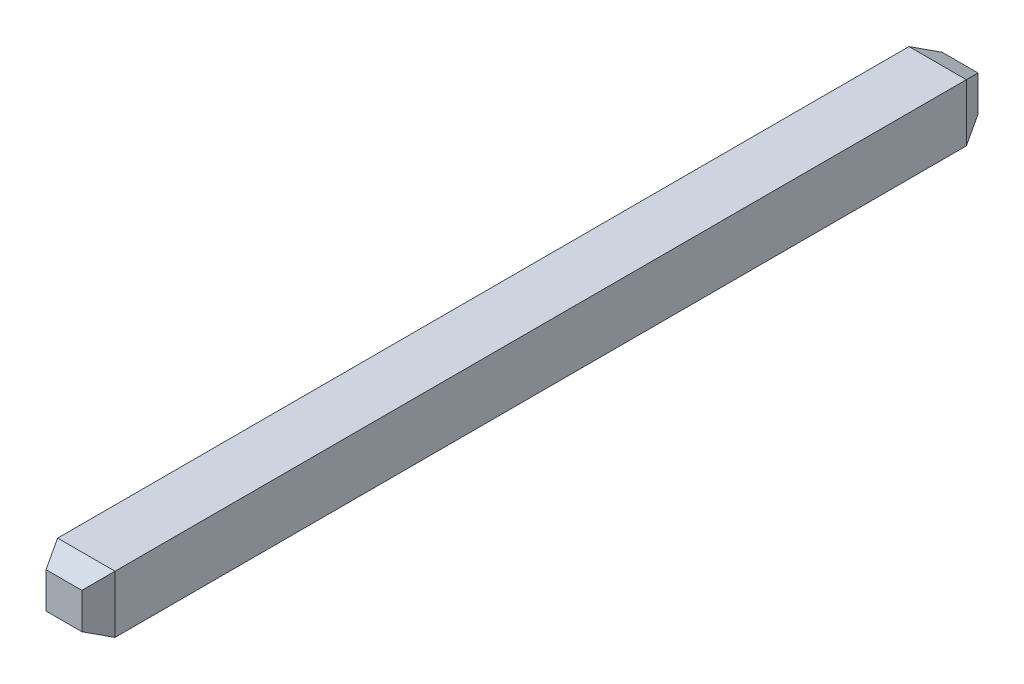
ISO-10303-21;
HEADER;
FILE_DESCRIPTION(('STEP AP214'),'2;1');
FILE_NAME('part.step','',(''),(''),'','','');
FILE_SCHEMA(('AUTOMOTIVE_DESIGN { 1 0 10303 214 1 1 1 1 }'));
ENDSEC;
DATA;
#1=APPLICATION_CONTEXT('core data for automotive mechanical design processes');
#2=APPLICATION_PROTOCOL_DEFINITION('international standard','automotive_design',2000,#1);
#3=PRODUCT_CONTEXT('',#1,'mechanical');
#4=PRODUCT('Part','Part','',(#3));
#5=PRODUCT_RELATED_PRODUCT_CATEGORY('part','',(#4));
#6=PRODUCT_DEFINITION_FORMATION('','',#4);
#7=PRODUCT_DEFINITION_CONTEXT('part definition',#1,'design');
#8=PRODUCT_DEFINITION('design','',#6,#7);
#9=PRODUCT_DEFINITION_SHAPE('','',#8);
#10=(LENGTH_UNIT() NAMED_UNIT(*) SI_UNIT(.MILLI.,.METRE.));
#11=(NAMED_UNIT(*) PLANE_ANGLE_UNIT() SI_UNIT($,.RADIAN.));
#12=(NAMED_UNIT(*) SI_UNIT($,.STERADIAN.) SOLID_ANGLE_UNIT());
#13=UNCERTAINTY_MEASURE_WITH_UNIT(LENGTH_MEASURE(1.E-05),#10,'distance_accuracy_value','');
#14=(GEOMETRIC_REPRESENTATION_CONTEXT(3) GLOBAL_UNCERTAINTY_ASSIGNED_CONTEXT((#13)) GLOBAL_UNIT_ASSIGNED_CONTEXT((#10,
#11,#12)) REPRESENTATION_CONTEXT('',''));
#15=CARTESIAN_POINT('',(0.,0.,0.));
#16=DIRECTION('',(0.,0.,1.));
#17=DIRECTION('',(1.,0.,0.));
#18=AXIS2_PLACEMENT_3D('',#15,#16,#17);
#19=CARTESIAN_POINT('',(0.16,0.32,2.5));
#20=DIRECTION('',(0.,1.,0.));
#21=DIRECTION('',(1.,0.,0.));
#22=AXIS2_PLACEMENT_3D('',#19,#20,#21);
#23=PLANE('',#22);
#24=DIRECTION('',(1.,0.,0.));
#25=VECTOR('',#24,1.);
#26=CARTESIAN_POINT('',(-0.08,0.32,4.75));
#27=LINE('',#26,#25);
#28=CARTESIAN_POINT('',(-0.32,0.32,4.75));
#29=VERTEX_POINT('',#28);
#30=CARTESIAN_POINT('',(0.32,0.32,4.75));
#31=VERTEX_POINT('',#30);
#32=EDGE_CURVE('E102',#29,#31,#27,.T.);
#33=ORIENTED_EDGE('',*,*,#32,.T.);
#34=DIRECTION('',(0.,0.,-1.));
#35=VECTOR('',#34,1.);
#36=CARTESIAN_POINT('',(0.32,0.32,0.));
#37=LINE('',#36,#35);
#38=CARTESIAN_POINT('',(0.32,0.32,-4.75));
#39=VERTEX_POINT('',#38);
#40=EDGE_CURVE('E27',#31,#39,#37,.T.);
#41=ORIENTED_EDGE('',*,*,#40,.T.);
#42=DIRECTION('',(1.,0.,0.));
#43=VECTOR('',#42,1.);
#44=CARTESIAN_POINT('',(-0.08,0.32,-4.75));
#45=LINE('',#44,#43);
#46=CARTESIAN_POINT('',(-0.32,0.32,-4.75));
#47=VERTEX_POINT('',#46);
#48=EDGE_CURVE('E133',#47,#39,#45,.T.);
#49=ORIENTED_EDGE('',*,*,#48,.F.);
#50=DIRECTION('',(0.,0.,1.));
#51=VECTOR('',#50,1.);
#52=CARTESIAN_POINT('',(-0.32,0.32,0.));
#53=LINE('',#52,#51);
#54=EDGE_CURVE('E207',#47,#29,#53,.T.);
#55=ORIENTED_EDGE('',*,*,#54,.T.);
#56=EDGE_LOOP('',(#33,#41,#49,#55));
#57=FACE_BOUND('',#56,.T.);
#58=ADVANCED_FACE('F17',(#57),#23,.T.);
#59=CARTESIAN_POINT('',(0.2,0.,5.));
#60=DIRECTION('',(0.901523057468274,0.,0.432731067584771));
#61=DIRECTION('',(0.,-1.,0.));
#62=AXIS2_PLACEMENT_3D('',#59,#60,#61);
#63=PLANE('',#62);
#64=DIRECTION('',(0.397142035392897,0.397142035392897,-0.827379240401869));
#65=VECTOR('',#64,1.);
#66=CARTESIAN_POINT('',(0.218992332968237,0.218992332968237,4.96043263964951));
#67=LINE('',#66,#65);
#68=CARTESIAN_POINT('',(0.2,0.2,5.));
#69=VERTEX_POINT('',#68);
#70=EDGE_CURVE('E176',#69,#31,#67,.T.);
#71=ORIENTED_EDGE('',*,*,#70,.F.);
#72=DIRECTION('',(0.,1.,0.));
#73=VECTOR('',#72,1.);
#74=CARTESIAN_POINT('',(0.2,0.,5.));
#75=LINE('',#74,#73);
#76=CARTESIAN_POINT('',(0.2,-0.2,5.));
#77=VERTEX_POINT('',#76);
#78=EDGE_CURVE('E61',#77,#69,#75,.T.);
#79=ORIENTED_EDGE('',*,*,#78,.F.);
#80=DIRECTION('',(0.397142035392897,-0.397142035392897,-0.827379240401869));
#81=VECTOR('',#80,1.);
#82=CARTESIAN_POINT('',(0.218992332968237,-0.218992332968237,4.96043263964951));
#83=LINE('',#82,#81);
#84=CARTESIAN_POINT('',(0.32,-0.32,4.75));
#85=VERTEX_POINT('',#84);
#86=EDGE_CURVE('E168',#77,#85,#83,.T.);
#87=ORIENTED_EDGE('',*,*,#86,.T.);
#88=DIRECTION('',(0.,1.,0.));
#89=VECTOR('',#88,1.);
#90=CARTESIAN_POINT('',(0.32,0.,4.75));
#91=LINE('',#90,#89);
#92=EDGE_CURVE('E11',#85,#31,#91,.T.);
#93=ORIENTED_EDGE('',*,*,#92,.T.);
#94=EDGE_LOOP('',(#71,#79,#87,#93));
#95=FACE_BOUND('',#94,.T.);
#96=ADVANCED_FACE('F19',(#95),#63,.T.);
#97=CARTESIAN_POINT('',(0.32,0.,4.75));
#98=DIRECTION('',(1.,0.,0.));
#99=DIRECTION('',(0.,1.,0.));
#100=AXIS2_PLACEMENT_3D('',#97,#98,#99);
#101=PLANE('',#100);
#102=ORIENTED_EDGE('',*,*,#40,.F.);
#103=ORIENTED_EDGE('',*,*,#92,.F.);
#104=DIRECTION('',(0.,0.,1.));
#105=VECTOR('',#104,1.);
#106=CARTESIAN_POINT('',(0.32,-0.32,0.));
#107=LINE('',#106,#105);
#108=CARTESIAN_POINT('',(0.32,-0.32,-4.75));
#109=VERTEX_POINT('',#108);
#110=EDGE_CURVE('E111',#109,#85,#107,.T.);
#111=ORIENTED_EDGE('',*,*,#110,.F.);
#112=DIRECTION('',(0.,1.,0.));
#113=VECTOR('',#112,1.);
#114=CARTESIAN_POINT('',(0.32,0.,-4.75));
#115=LINE('',#114,#113);
#116=EDGE_CURVE('E132',#109,#39,#115,.T.);
#117=ORIENTED_EDGE('',*,*,#116,.T.);
#118=EDGE_LOOP('',(#102,#103,#111,#117));
#119=FACE_BOUND('',#118,.T.);
#120=ADVANCED_FACE('F226',(#119),#101,.T.);
#121=CARTESIAN_POINT('',(0.,0.,5.));
#122=DIRECTION('',(0.,0.,1.));
#123=DIRECTION('',(1.,0.,0.));
#124=AXIS2_PLACEMENT_3D('',#121,#122,#123);
#125=PLANE('',#124);
#126=DIRECTION('',(1.,0.,0.));
#127=VECTOR('',#126,1.);
#128=CARTESIAN_POINT('',(0.,0.2,5.));
#129=LINE('',#128,#127);
#130=CARTESIAN_POINT('',(-0.2,0.2,5.));
#131=VERTEX_POINT('',#130);
#132=EDGE_CURVE('E215',#131,#69,#129,.T.);
#133=ORIENTED_EDGE('',*,*,#132,.F.);
#134=DIRECTION('',(0.,1.,0.));
#135=VECTOR('',#134,1.);
#136=CARTESIAN_POINT('',(-0.2,0.,5.));
#137=LINE('',#136,#135);
#138=CARTESIAN_POINT('',(-0.2,-0.2,5.));
#139=VERTEX_POINT('',#138);
#140=EDGE_CURVE('E172',#139,#131,#137,.T.);
#141=ORIENTED_EDGE('',*,*,#140,.F.);
#142=DIRECTION('',(1.,0.,0.));
#143=VECTOR('',#142,1.);
#144=CARTESIAN_POINT('',(0.,-0.2,5.));
#145=LINE('',#144,#143);
#146=EDGE_CURVE('E164',#139,#77,#145,.T.);
#147=ORIENTED_EDGE('',*,*,#146,.T.);
#148=ORIENTED_EDGE('',*,*,#78,.T.);
#149=EDGE_LOOP('',(#133,#141,#147,#148));
#150=FACE_BOUND('',#149,.T.);
#151=ADVANCED_FACE('F251',(#150),#125,.T.);
#152=CARTESIAN_POINT('',(0.,0.32,4.75));
#153=DIRECTION('',(0.,0.901523057468274,0.432731067584771));
#154=DIRECTION('',(1.,0.,0.));
#155=AXIS2_PLACEMENT_3D('',#152,#153,#154);
#156=PLANE('',#155);
#157=ORIENTED_EDGE('',*,*,#70,.T.);
#158=ORIENTED_EDGE('',*,*,#32,.F.);
#159=DIRECTION('',(-0.397142035392897,0.397142035392897,-0.827379240401869));
#160=VECTOR('',#159,1.);
#161=CARTESIAN_POINT('',(-0.218992332968237,0.218992332968237,4.96043263964951));
#162=LINE('',#161,#160);
#163=EDGE_CURVE('E177',#131,#29,#162,.T.);
#164=ORIENTED_EDGE('',*,*,#163,.F.);
#165=ORIENTED_EDGE('',*,*,#132,.T.);
#166=EDGE_LOOP('',(#157,#158,#164,#165));
#167=FACE_BOUND('',#166,.T.);
#168=ADVANCED_FACE('F244',(#167),#156,.T.);
#169=CARTESIAN_POINT('',(-0.2,0.,5.));
#170=DIRECTION('',(0.901523057468274,0.,-0.432731067584771));
#171=DIRECTION('',(0.,-1.,0.));
#172=AXIS2_PLACEMENT_3D('',#169,#170,#171);
#173=PLANE('',#172);
#174=ORIENTED_EDGE('',*,*,#163,.T.);
#175=DIRECTION('',(0.,-1.,0.));
#176=VECTOR('',#175,1.);
#177=CARTESIAN_POINT('',(-0.32,0.,4.75));
#178=LINE('',#177,#176);
#179=CARTESIAN_POINT('',(-0.32,-0.32,4.75));
#180=VERTEX_POINT('',#179);
#181=EDGE_CURVE('E90',#29,#180,#178,.T.);
#182=ORIENTED_EDGE('',*,*,#181,.T.);
#183=DIRECTION('',(-0.397142035392897,-0.397142035392897,-0.827379240401869));
#184=VECTOR('',#183,1.);
#185=CARTESIAN_POINT('',(-0.218992332968237,-0.218992332968237,4.96043263964951));
#186=LINE('',#185,#184);
#187=EDGE_CURVE('E167',#139,#180,#186,.T.);
#188=ORIENTED_EDGE('',*,*,#187,.F.);
#189=ORIENTED_EDGE('',*,*,#140,.T.);
#190=EDGE_LOOP('',(#174,#182,#188,#189));
#191=FACE_BOUND('',#190,.T.);
#192=ADVANCED_FACE('F242',(#191),#173,.F.);
#193=CARTESIAN_POINT('',(-0.32,0.,4.75));
#194=DIRECTION('',(1.,0.,0.));
#195=DIRECTION('',(0.,0.,-1.));
#196=AXIS2_PLACEMENT_3D('',#193,#194,#195);
#197=PLANE('',#196);
#198=ORIENTED_EDGE('',*,*,#181,.F.);
#199=ORIENTED_EDGE('',*,*,#54,.F.);
#200=DIRECTION('',(0.,-1.,0.));
#201=VECTOR('',#200,1.);
#202=CARTESIAN_POINT('',(-0.32,0.,-4.75));
#203=LINE('',#202,#201);
#204=CARTESIAN_POINT('',(-0.32,-0.32,-4.75));
#205=VERTEX_POINT('',#204);
#206=EDGE_CURVE('E156',#47,#205,#203,.T.);
#207=ORIENTED_EDGE('',*,*,#206,.T.);
#208=DIRECTION('',(0.,0.,1.));
#209=VECTOR('',#208,1.);
#210=CARTESIAN_POINT('',(-0.32,-0.32,0.));
#211=LINE('',#210,#209);
#212=EDGE_CURVE('E200',#205,#180,#211,.T.);
#213=ORIENTED_EDGE('',*,*,#212,.T.);
#214=EDGE_LOOP('',(#198,#199,#207,#213));
#215=FACE_BOUND('',#214,.T.);
#216=ADVANCED_FACE('F234',(#215),#197,.F.);
#217=CARTESIAN_POINT('',(0.16,-0.32,2.5));
#218=DIRECTION('',(0.,1.,0.));
#219=DIRECTION('',(1.,0.,0.));
#220=AXIS2_PLACEMENT_3D('',#217,#218,#219);
#221=PLANE('',#220);
#222=DIRECTION('',(1.,0.,0.));
#223=VECTOR('',#222,1.);
#224=CARTESIAN_POINT('',(-0.08,-0.32,4.75));
#225=LINE('',#224,#223);
#226=EDGE_CURVE('E196',#180,#85,#225,.T.);
#227=ORIENTED_EDGE('',*,*,#226,.F.);
#228=ORIENTED_EDGE('',*,*,#212,.F.);
#229=DIRECTION('',(1.,0.,0.));
#230=VECTOR('',#229,1.);
#231=CARTESIAN_POINT('',(-0.08,-0.32,-4.75));
#232=LINE('',#231,#230);
#233=EDGE_CURVE('E148',#205,#109,#232,.T.);
#234=ORIENTED_EDGE('',*,*,#233,.T.);
#235=ORIENTED_EDGE('',*,*,#110,.T.);
#236=EDGE_LOOP('',(#227,#228,#234,#235));
#237=FACE_BOUND('',#236,.T.);
#238=ADVANCED_FACE('F237',(#237),#221,.F.);
#239=CARTESIAN_POINT('',(0.,-0.32,4.75));
#240=DIRECTION('',(0.,0.901523057468274,-0.432731067584771));
#241=DIRECTION('',(-1.,0.,0.));
#242=AXIS2_PLACEMENT_3D('',#239,#240,#241);
#243=PLANE('',#242);
#244=ORIENTED_EDGE('',*,*,#86,.F.);
#245=ORIENTED_EDGE('',*,*,#146,.F.);
#246=ORIENTED_EDGE('',*,*,#187,.T.);
#247=ORIENTED_EDGE('',*,*,#226,.T.);
#248=EDGE_LOOP('',(#244,#245,#246,#247));
#249=FACE_BOUND('',#248,.T.);
#250=ADVANCED_FACE('F241',(#249),#243,.F.);
#251=CARTESIAN_POINT('',(0.2,0.,-5.));
#252=DIRECTION('',(-0.901523057468274,0.,0.432731067584771));
#253=DIRECTION('',(0.,1.,0.));
#254=AXIS2_PLACEMENT_3D('',#251,#252,#253);
#255=PLANE('',#254);
#256=DIRECTION('',(0.397142035392897,0.397142035392897,0.827379240401869));
#257=VECTOR('',#256,1.);
#258=CARTESIAN_POINT('',(0.218992332968237,0.218992332968237,-4.96043263964951));
#259=LINE('',#258,#257);
#260=CARTESIAN_POINT('',(0.2,0.2,-5.));
#261=VERTEX_POINT('',#260);
#262=EDGE_CURVE('E159',#261,#39,#259,.T.);
#263=ORIENTED_EDGE('',*,*,#262,.T.);
#264=ORIENTED_EDGE('',*,*,#116,.F.);
#265=DIRECTION('',(0.397142035392897,-0.397142035392897,0.827379240401869));
#266=VECTOR('',#265,1.);
#267=CARTESIAN_POINT('',(0.218992332968237,-0.218992332968237,-4.96043263964951));
#268=LINE('',#267,#266);
#269=CARTESIAN_POINT('',(0.2,-0.2,-5.));
#270=VERTEX_POINT('',#269);
#271=EDGE_CURVE('E139',#270,#109,#268,.T.);
#272=ORIENTED_EDGE('',*,*,#271,.F.);
#273=DIRECTION('',(0.,1.,0.));
#274=VECTOR('',#273,1.);
#275=CARTESIAN_POINT('',(0.2,0.,-5.));
#276=LINE('',#275,#274);
#277=EDGE_CURVE('E120',#270,#261,#276,.T.);
#278=ORIENTED_EDGE('',*,*,#277,.T.);
#279=EDGE_LOOP('',(#263,#264,#272,#278));
#280=FACE_BOUND('',#279,.T.);
#281=ADVANCED_FACE('F145',(#280),#255,.F.);
#282=CARTESIAN_POINT('',(0.,0.,-5.));
#283=DIRECTION('',(0.,0.,1.));
#284=DIRECTION('',(1.,0.,0.));
#285=AXIS2_PLACEMENT_3D('',#282,#283,#284);
#286=PLANE('',#285);
#287=DIRECTION('',(1.,0.,0.));
#288=VECTOR('',#287,1.);
#289=CARTESIAN_POINT('',(0.,0.2,-5.));
#290=LINE('',#289,#288);
#291=CARTESIAN_POINT('',(-0.2,0.2,-5.));
#292=VERTEX_POINT('',#291);
#293=EDGE_CURVE('E126',#292,#261,#290,.T.);
#294=ORIENTED_EDGE('',*,*,#293,.T.);
#295=ORIENTED_EDGE('',*,*,#277,.F.);
#296=DIRECTION('',(1.,0.,0.));
#297=VECTOR('',#296,1.);
#298=CARTESIAN_POINT('',(0.,-0.2,-5.));
#299=LINE('',#298,#297);
#300=CARTESIAN_POINT('',(-0.2,-0.2,-5.));
#301=VERTEX_POINT('',#300);
#302=EDGE_CURVE('E124',#301,#270,#299,.T.);
#303=ORIENTED_EDGE('',*,*,#302,.F.);
#304=DIRECTION('',(0.,1.,0.));
#305=VECTOR('',#304,1.);
#306=CARTESIAN_POINT('',(-0.2,0.,-5.));
#307=LINE('',#306,#305);
#308=EDGE_CURVE('E160',#301,#292,#307,.T.);
#309=ORIENTED_EDGE('',*,*,#308,.T.);
#310=EDGE_LOOP('',(#294,#295,#303,#309));
#311=FACE_BOUND('',#310,.T.);
#312=ADVANCED_FACE('F122',(#311),#286,.F.);
#313=CARTESIAN_POINT('',(0.,0.32,-4.75));
#314=DIRECTION('',(0.,-0.901523057468274,0.432731067584771));
#315=DIRECTION('',(-1.,0.,0.));
#316=AXIS2_PLACEMENT_3D('',#313,#314,#315);
#317=PLANE('',#316);
#318=ORIENTED_EDGE('',*,*,#262,.F.);
#319=ORIENTED_EDGE('',*,*,#293,.F.);
#320=DIRECTION('',(-0.397142035392897,0.397142035392897,0.827379240401869));
#321=VECTOR('',#320,1.);
#322=CARTESIAN_POINT('',(-0.218992332968236,0.218992332968237,-4.96043263964951));
#323=LINE('',#322,#321);
#324=EDGE_CURVE('E143',#292,#47,#323,.T.);
#325=ORIENTED_EDGE('',*,*,#324,.T.);
#326=ORIENTED_EDGE('',*,*,#48,.T.);
#327=EDGE_LOOP('',(#318,#319,#325,#326));
#328=FACE_BOUND('',#327,.T.);
#329=ADVANCED_FACE('F228',(#328),#317,.F.);
#330=CARTESIAN_POINT('',(-0.2,0.,-5.));
#331=DIRECTION('',(-0.901523057468274,0.,-0.432731067584771));
#332=DIRECTION('',(-0.432731067584771,0.,0.901523057468274));
#333=AXIS2_PLACEMENT_3D('',#330,#331,#332);
#334=PLANE('',#333);
#335=ORIENTED_EDGE('',*,*,#324,.F.);
#336=ORIENTED_EDGE('',*,*,#308,.F.);
#337=DIRECTION('',(-0.397142035392897,-0.397142035392897,0.827379240401869));
#338=VECTOR('',#337,1.);
#339=CARTESIAN_POINT('',(-0.218992332968236,-0.218992332968237,-4.96043263964951));
#340=LINE('',#339,#338);
#341=EDGE_CURVE('E141',#301,#205,#340,.T.);
#342=ORIENTED_EDGE('',*,*,#341,.T.);
#343=ORIENTED_EDGE('',*,*,#206,.F.);
#344=EDGE_LOOP('',(#335,#336,#342,#343));
#345=FACE_BOUND('',#344,.T.);
#346=ADVANCED_FACE('F232',(#345),#334,.T.);
#347=CARTESIAN_POINT('',(0.,-0.32,-4.75));
#348=DIRECTION('',(0.,-0.901523057468274,-0.432731067584771));
#349=DIRECTION('',(0.,0.432731067584771,-0.901523057468274));
#350=AXIS2_PLACEMENT_3D('',#347,#348,#349);
#351=PLANE('',#350);
#352=ORIENTED_EDGE('',*,*,#271,.T.);
#353=ORIENTED_EDGE('',*,*,#233,.F.);
#354=ORIENTED_EDGE('',*,*,#341,.F.);
#355=ORIENTED_EDGE('',*,*,#302,.T.);
#356=EDGE_LOOP('',(#352,#353,#354,#355));
#357=FACE_BOUND('',#356,.T.);
#358=ADVANCED_FACE('F137',(#357),#351,.T.);
#359=CLOSED_SHELL('',(#58,#96,#120,#151,#168,#192,#216,#238,#250,#281,#312,#329,#346,#358));
#360=MANIFOLD_SOLID_BREP('B1',#359);
#361=ADVANCED_BREP_SHAPE_REPRESENTATION('',(#18,#360),#14);
#362=SHAPE_DEFINITION_REPRESENTATION(#9,#361);
ENDSEC;
END-ISO-10303-21;
